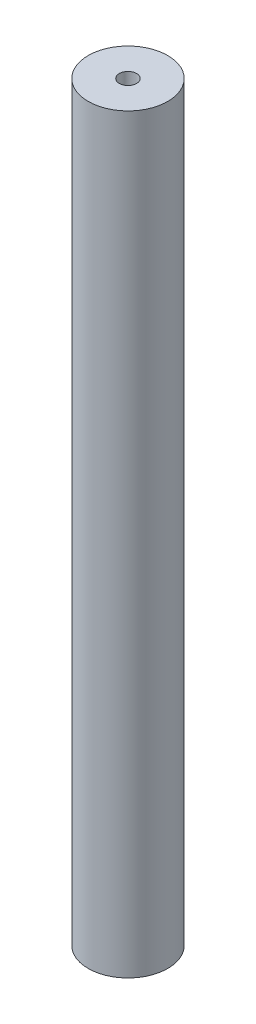
ISO-10303-21;
HEADER;
FILE_DESCRIPTION(('STEP AP214'),'2;1');
FILE_NAME('part.step','',(''),(''),'','','');
FILE_SCHEMA(('AUTOMOTIVE_DESIGN { 1 0 10303 214 1 1 1 1 }'));
ENDSEC;
DATA;
#1=APPLICATION_CONTEXT('core data for automotive mechanical design processes');
#2=APPLICATION_PROTOCOL_DEFINITION('international standard','automotive_design',2000,#1);
#3=PRODUCT_CONTEXT('',#1,'mechanical');
#4=PRODUCT('Part','Part','',(#3));
#5=PRODUCT_RELATED_PRODUCT_CATEGORY('part','',(#4));
#6=PRODUCT_DEFINITION_FORMATION('','',#4);
#7=PRODUCT_DEFINITION_CONTEXT('part definition',#1,'design');
#8=PRODUCT_DEFINITION('design','',#6,#7);
#9=PRODUCT_DEFINITION_SHAPE('','',#8);
#10=(LENGTH_UNIT() NAMED_UNIT(*) SI_UNIT(.MILLI.,.METRE.));
#11=(NAMED_UNIT(*) PLANE_ANGLE_UNIT() SI_UNIT($,.RADIAN.));
#12=(NAMED_UNIT(*) SI_UNIT($,.STERADIAN.) SOLID_ANGLE_UNIT());
#13=UNCERTAINTY_MEASURE_WITH_UNIT(LENGTH_MEASURE(1.E-05),#10,'distance_accuracy_value','');
#14=(GEOMETRIC_REPRESENTATION_CONTEXT(3) GLOBAL_UNCERTAINTY_ASSIGNED_CONTEXT((#13)) GLOBAL_UNIT_ASSIGNED_CONTEXT((#10,
#11,#12)) REPRESENTATION_CONTEXT('',''));
#15=CARTESIAN_POINT('',(0.,0.,0.));
#16=DIRECTION('',(0.,0.,1.));
#17=DIRECTION('',(1.,0.,0.));
#18=AXIS2_PLACEMENT_3D('',#15,#16,#17);
#19=CARTESIAN_POINT('',(0.,149.86,0.));
#20=DIRECTION('',(0.,-1.,0.));
#21=DIRECTION('',(0.,0.,-1.));
#22=AXIS2_PLACEMENT_3D('',#19,#20,#21);
#23=CYLINDRICAL_SURFACE('',#22,7.9375);
#24=CARTESIAN_POINT('',(0.,149.86,0.));
#25=DIRECTION('',(0.,1.,0.));
#26=DIRECTION('',(0.,0.,1.));
#27=AXIS2_PLACEMENT_3D('',#24,#25,#26);
#28=CIRCLE('',#27,7.9375);
#29=CARTESIAN_POINT('',(0.,149.86,7.9375));
#30=VERTEX_POINT('',#29);
#31=EDGE_CURVE('E11',#30,#30,#28,.T.);
#32=ORIENTED_EDGE('',*,*,#31,.F.);
#33=EDGE_LOOP('',(#32));
#34=FACE_BOUND('',#33,.T.);
#35=CARTESIAN_POINT('',(0.,0.,0.));
#36=DIRECTION('',(0.,1.,0.));
#37=DIRECTION('',(0.,0.,1.));
#38=AXIS2_PLACEMENT_3D('',#35,#36,#37);
#39=CIRCLE('',#38,7.9375);
#40=CARTESIAN_POINT('',(0.,0.,7.9375));
#41=VERTEX_POINT('',#40);
#42=EDGE_CURVE('E38',#41,#41,#39,.T.);
#43=ORIENTED_EDGE('',*,*,#42,.T.);
#44=EDGE_LOOP('',(#43));
#45=FACE_BOUND('',#44,.T.);
#46=ADVANCED_FACE('F35',(#34,#45),#23,.T.);
#47=CARTESIAN_POINT('',(0.,149.86,0.));
#48=DIRECTION('',(0.,1.,0.));
#49=DIRECTION('',(0.,0.,1.));
#50=AXIS2_PLACEMENT_3D('',#47,#48,#49);
#51=PLANE('',#50);
#52=CARTESIAN_POINT('',(0.,149.86,0.));
#53=DIRECTION('',(0.,1.,0.));
#54=DIRECTION('',(0.,0.,1.));
#55=AXIS2_PLACEMENT_3D('',#52,#53,#54);
#56=CIRCLE('',#55,1.7272);
#57=CARTESIAN_POINT('',(0.,149.86,1.7272));
#58=VERTEX_POINT('',#57);
#59=EDGE_CURVE('E59',#58,#58,#56,.T.);
#60=ORIENTED_EDGE('',*,*,#59,.F.);
#61=EDGE_LOOP('',(#60));
#62=FACE_BOUND('',#61,.T.);
#63=ORIENTED_EDGE('',*,*,#31,.T.);
#64=EDGE_LOOP('',(#63));
#65=FACE_BOUND('',#64,.T.);
#66=ADVANCED_FACE('F77',(#62,#65),#51,.T.);
#67=CARTESIAN_POINT('',(0.,0.,0.));
#68=DIRECTION('',(0.,1.,0.));
#69=DIRECTION('',(0.,0.,1.));
#70=AXIS2_PLACEMENT_3D('',#67,#68,#69);
#71=PLANE('',#70);
#72=CARTESIAN_POINT('',(0.,0.,0.));
#73=DIRECTION('',(0.,-1.,0.));
#74=DIRECTION('',(0.,0.,-1.));
#75=AXIS2_PLACEMENT_3D('',#72,#73,#74);
#76=CIRCLE('',#75,1.7272);
#77=CARTESIAN_POINT('',(0.,0.,-1.7272));
#78=VERTEX_POINT('',#77);
#79=EDGE_CURVE('E58',#78,#78,#76,.T.);
#80=ORIENTED_EDGE('',*,*,#79,.F.);
#81=EDGE_LOOP('',(#80));
#82=FACE_BOUND('',#81,.T.);
#83=ORIENTED_EDGE('',*,*,#42,.F.);
#84=EDGE_LOOP('',(#83));
#85=FACE_BOUND('',#84,.T.);
#86=ADVANCED_FACE('F74',(#82,#85),#71,.F.);
#87=CARTESIAN_POINT('',(0.,12.7,0.));
#88=DIRECTION('',(0.,-1.,0.));
#89=DIRECTION('',(0.,0.,-1.));
#90=AXIS2_PLACEMENT_3D('',#87,#88,#89);
#91=CONICAL_SURFACE('',#90,1.7272,1.02974425867665);
#92=CARTESIAN_POINT('',(0.,13.7378064611844,0.));
#93=VERTEX_POINT('',#92);
#94=VERTEX_LOOP('',#93);
#95=FACE_BOUND('',#94,.T.);
#96=CARTESIAN_POINT('',(0.,12.7,0.));
#97=DIRECTION('',(0.,-1.,0.));
#98=DIRECTION('',(0.,0.,-1.));
#99=AXIS2_PLACEMENT_3D('',#96,#97,#98);
#100=CIRCLE('',#99,1.7272);
#101=CARTESIAN_POINT('',(0.,12.7,-1.7272));
#102=VERTEX_POINT('',#101);
#103=EDGE_CURVE('E62',#102,#102,#100,.T.);
#104=ORIENTED_EDGE('',*,*,#103,.T.);
#105=EDGE_LOOP('',(#104));
#106=FACE_BOUND('',#105,.T.);
#107=ADVANCED_FACE('F76',(#95,#106),#91,.F.);
#108=CARTESIAN_POINT('',(0.,0.,0.));
#109=DIRECTION('',(0.,-1.,0.));
#110=DIRECTION('',(0.,0.,-1.));
#111=AXIS2_PLACEMENT_3D('',#108,#109,#110);
#112=CYLINDRICAL_SURFACE('',#111,1.7272);
#113=ORIENTED_EDGE('',*,*,#103,.F.);
#114=EDGE_LOOP('',(#113));
#115=FACE_BOUND('',#114,.T.);
#116=ORIENTED_EDGE('',*,*,#79,.T.);
#117=EDGE_LOOP('',(#116));
#118=FACE_BOUND('',#117,.T.);
#119=ADVANCED_FACE('F52',(#115,#118),#112,.F.);
#120=CARTESIAN_POINT('',(0.,137.16,0.));
#121=DIRECTION('',(0.,1.,0.));
#122=DIRECTION('',(0.,0.,1.));
#123=AXIS2_PLACEMENT_3D('',#120,#121,#122);
#124=CONICAL_SURFACE('',#123,1.7272,1.02974425867664);
#125=CARTESIAN_POINT('',(0.,136.122193538816,0.));
#126=VERTEX_POINT('',#125);
#127=VERTEX_LOOP('',#126);
#128=FACE_BOUND('',#127,.T.);
#129=CARTESIAN_POINT('',(0.,137.16,0.));
#130=DIRECTION('',(0.,1.,0.));
#131=DIRECTION('',(0.,0.,1.));
#132=AXIS2_PLACEMENT_3D('',#129,#130,#131);
#133=CIRCLE('',#132,1.7272);
#134=CARTESIAN_POINT('',(0.,137.16,1.7272));
#135=VERTEX_POINT('',#134);
#136=EDGE_CURVE('E56',#135,#135,#133,.T.);
#137=ORIENTED_EDGE('',*,*,#136,.T.);
#138=EDGE_LOOP('',(#137));
#139=FACE_BOUND('',#138,.T.);
#140=ADVANCED_FACE('F48',(#128,#139),#124,.F.);
#141=CARTESIAN_POINT('',(0.,149.86,0.));
#142=DIRECTION('',(0.,1.,0.));
#143=DIRECTION('',(0.,0.,1.));
#144=AXIS2_PLACEMENT_3D('',#141,#142,#143);
#145=CYLINDRICAL_SURFACE('',#144,1.7272);
#146=ORIENTED_EDGE('',*,*,#136,.F.);
#147=EDGE_LOOP('',(#146));
#148=FACE_BOUND('',#147,.T.);
#149=ORIENTED_EDGE('',*,*,#59,.T.);
#150=EDGE_LOOP('',(#149));
#151=FACE_BOUND('',#150,.T.);
#152=ADVANCED_FACE('F51',(#148,#151),#145,.F.);
#153=CLOSED_SHELL('',(#46,#66,#86,#107,#119,#140,#152));
#154=MANIFOLD_SOLID_BREP('B2',#153);
#155=ADVANCED_BREP_SHAPE_REPRESENTATION('',(#18,#154),#14);
#156=SHAPE_DEFINITION_REPRESENTATION(#9,#155);
ENDSEC;
END-ISO-10303-21;
